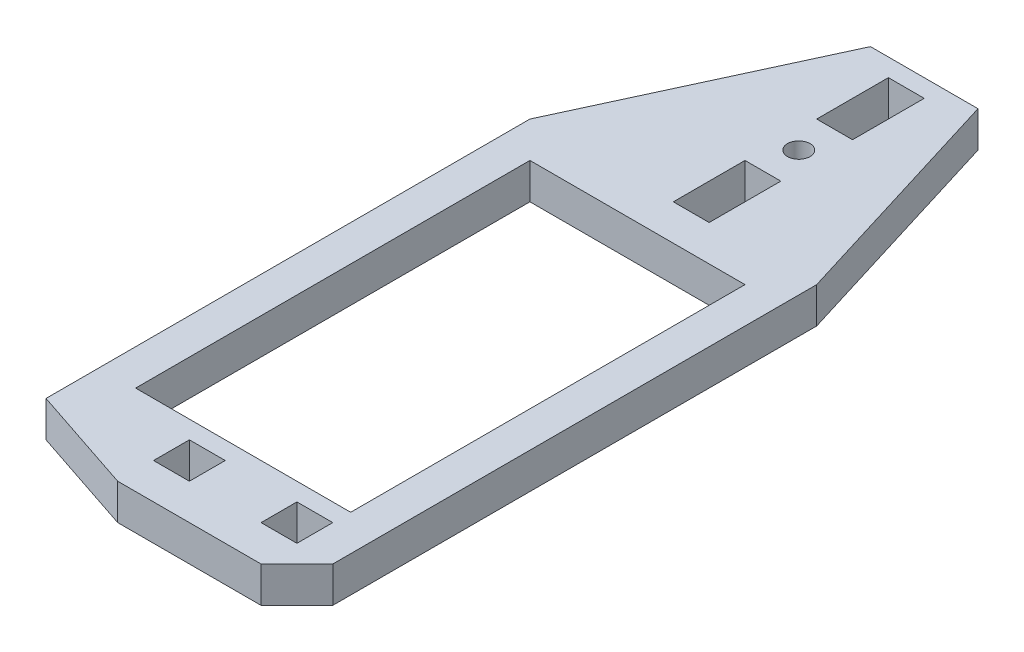
ISO-10303-21;
HEADER;
FILE_DESCRIPTION(('STEP AP214'),'2;1');
FILE_NAME('part.step','',(''),(''),'','','');
FILE_SCHEMA(('AUTOMOTIVE_DESIGN { 1 0 10303 214 1 1 1 1 }'));
ENDSEC;
DATA;
#1=APPLICATION_CONTEXT('core data for automotive mechanical design processes');
#2=APPLICATION_PROTOCOL_DEFINITION('international standard','automotive_design',2000,#1);
#3=PRODUCT_CONTEXT('',#1,'mechanical');
#4=PRODUCT('Part','Part','',(#3));
#5=PRODUCT_RELATED_PRODUCT_CATEGORY('part','',(#4));
#6=PRODUCT_DEFINITION_FORMATION('','',#4);
#7=PRODUCT_DEFINITION_CONTEXT('part definition',#1,'design');
#8=PRODUCT_DEFINITION('design','',#6,#7);
#9=PRODUCT_DEFINITION_SHAPE('','',#8);
#10=(LENGTH_UNIT() NAMED_UNIT(*) SI_UNIT(.MILLI.,.METRE.));
#11=(NAMED_UNIT(*) PLANE_ANGLE_UNIT() SI_UNIT($,.RADIAN.));
#12=(NAMED_UNIT(*) SI_UNIT($,.STERADIAN.) SOLID_ANGLE_UNIT());
#13=UNCERTAINTY_MEASURE_WITH_UNIT(LENGTH_MEASURE(1.E-05),#10,'distance_accuracy_value','');
#14=(GEOMETRIC_REPRESENTATION_CONTEXT(3) GLOBAL_UNCERTAINTY_ASSIGNED_CONTEXT((#13)) GLOBAL_UNIT_ASSIGNED_CONTEXT((#10,
#11,#12)) REPRESENTATION_CONTEXT('',''));
#15=CARTESIAN_POINT('',(0.,0.,0.));
#16=DIRECTION('',(0.,0.,1.));
#17=DIRECTION('',(1.,0.,0.));
#18=AXIS2_PLACEMENT_3D('',#15,#16,#17);
#19=CARTESIAN_POINT('',(38.1,6.35,0.));
#20=DIRECTION('',(-1.,0.,0.));
#21=DIRECTION('',(0.,0.,1.));
#22=AXIS2_PLACEMENT_3D('',#19,#20,#21);
#23=PLANE('',#22);
#24=DIRECTION('',(0.,0.,-1.));
#25=VECTOR('',#24,1.);
#26=CARTESIAN_POINT('',(38.1,0.,0.));
#27=LINE('',#26,#25);
#28=CARTESIAN_POINT('',(38.1,0.,0.));
#29=VERTEX_POINT('',#28);
#30=CARTESIAN_POINT('',(38.1,0.,-69.85));
#31=VERTEX_POINT('',#30);
#32=EDGE_CURVE('E329',#29,#31,#27,.T.);
#33=ORIENTED_EDGE('',*,*,#32,.F.);
#34=DIRECTION('',(0.,-1.,0.));
#35=VECTOR('',#34,1.);
#36=CARTESIAN_POINT('',(38.1,6.35,0.));
#37=LINE('',#36,#35);
#38=CARTESIAN_POINT('',(38.1,6.35,0.));
#39=VERTEX_POINT('',#38);
#40=EDGE_CURVE('E11',#39,#29,#37,.T.);
#41=ORIENTED_EDGE('',*,*,#40,.F.);
#42=DIRECTION('',(0.,0.,-1.));
#43=VECTOR('',#42,1.);
#44=CARTESIAN_POINT('',(38.1,6.35,0.));
#45=LINE('',#44,#43);
#46=CARTESIAN_POINT('',(38.1,6.35,-69.85));
#47=VERTEX_POINT('',#46);
#48=EDGE_CURVE('E248',#39,#47,#45,.T.);
#49=ORIENTED_EDGE('',*,*,#48,.T.);
#50=DIRECTION('',(0.,-1.,0.));
#51=VECTOR('',#50,1.);
#52=CARTESIAN_POINT('',(38.1,6.35,-69.85));
#53=LINE('',#52,#51);
#54=EDGE_CURVE('E149',#47,#31,#53,.T.);
#55=ORIENTED_EDGE('',*,*,#54,.T.);
#56=EDGE_LOOP('',(#33,#41,#49,#55));
#57=FACE_BOUND('',#56,.T.);
#58=ADVANCED_FACE('F35',(#57),#23,.T.);
#59=CARTESIAN_POINT('',(0.,6.35,0.));
#60=DIRECTION('',(0.,0.,-1.));
#61=DIRECTION('',(-1.,0.,0.));
#62=AXIS2_PLACEMENT_3D('',#59,#60,#61);
#63=PLANE('',#62);
#64=DIRECTION('',(1.,0.,0.));
#65=VECTOR('',#64,1.);
#66=CARTESIAN_POINT('',(0.,0.,0.));
#67=LINE('',#66,#65);
#68=CARTESIAN_POINT('',(0.,0.,0.));
#69=VERTEX_POINT('',#68);
#70=EDGE_CURVE('E238',#69,#29,#67,.T.);
#71=ORIENTED_EDGE('',*,*,#70,.F.);
#72=DIRECTION('',(0.,-1.,0.));
#73=VECTOR('',#72,1.);
#74=CARTESIAN_POINT('',(0.,6.35,0.));
#75=LINE('',#74,#73);
#76=CARTESIAN_POINT('',(0.,6.35,0.));
#77=VERTEX_POINT('',#76);
#78=EDGE_CURVE('E45',#77,#69,#75,.T.);
#79=ORIENTED_EDGE('',*,*,#78,.F.);
#80=DIRECTION('',(1.,0.,0.));
#81=VECTOR('',#80,1.);
#82=CARTESIAN_POINT('',(0.,6.35,0.));
#83=LINE('',#82,#81);
#84=EDGE_CURVE('E236',#77,#39,#83,.T.);
#85=ORIENTED_EDGE('',*,*,#84,.T.);
#86=ORIENTED_EDGE('',*,*,#40,.T.);
#87=EDGE_LOOP('',(#71,#79,#85,#86));
#88=FACE_BOUND('',#87,.T.);
#89=ADVANCED_FACE('F234',(#88),#63,.T.);
#90=CARTESIAN_POINT('',(0.,6.35,0.));
#91=DIRECTION('',(-1.,0.,0.));
#92=DIRECTION('',(0.,0.,1.));
#93=AXIS2_PLACEMENT_3D('',#90,#91,#92);
#94=PLANE('',#93);
#95=DIRECTION('',(0.,0.,-1.));
#96=VECTOR('',#95,1.);
#97=CARTESIAN_POINT('',(0.,0.,0.));
#98=LINE('',#97,#96);
#99=CARTESIAN_POINT('',(0.,0.,-69.85));
#100=VERTEX_POINT('',#99);
#101=EDGE_CURVE('E332',#69,#100,#98,.T.);
#102=ORIENTED_EDGE('',*,*,#101,.T.);
#103=DIRECTION('',(0.,-1.,0.));
#104=VECTOR('',#103,1.);
#105=CARTESIAN_POINT('',(0.,6.35,-69.85));
#106=LINE('',#105,#104);
#107=CARTESIAN_POINT('',(0.,6.35,-69.85));
#108=VERTEX_POINT('',#107);
#109=EDGE_CURVE('E241',#108,#100,#106,.T.);
#110=ORIENTED_EDGE('',*,*,#109,.F.);
#111=DIRECTION('',(0.,0.,-1.));
#112=VECTOR('',#111,1.);
#113=CARTESIAN_POINT('',(0.,6.35,0.));
#114=LINE('',#113,#112);
#115=EDGE_CURVE('E244',#77,#108,#114,.T.);
#116=ORIENTED_EDGE('',*,*,#115,.F.);
#117=ORIENTED_EDGE('',*,*,#78,.T.);
#118=EDGE_LOOP('',(#102,#110,#116,#117));
#119=FACE_BOUND('',#118,.T.);
#120=ADVANCED_FACE('F245',(#119),#94,.F.);
#121=CARTESIAN_POINT('',(31.75,6.35,0.));
#122=DIRECTION('',(1.,0.,0.));
#123=DIRECTION('',(0.,0.,-1.));
#124=AXIS2_PLACEMENT_3D('',#121,#122,#123);
#125=PLANE('',#124);
#126=DIRECTION('',(0.,0.,1.));
#127=VECTOR('',#126,1.);
#128=CARTESIAN_POINT('',(31.75,0.,0.));
#129=LINE('',#128,#127);
#130=CARTESIAN_POINT('',(31.75,0.,3.17499999999999));
#131=VERTEX_POINT('',#130);
#132=CARTESIAN_POINT('',(31.75,0.,9.525));
#133=VERTEX_POINT('',#132);
#134=EDGE_CURVE('E317',#131,#133,#129,.T.);
#135=ORIENTED_EDGE('',*,*,#134,.F.);
#136=DIRECTION('',(0.,-1.,0.));
#137=VECTOR('',#136,1.);
#138=CARTESIAN_POINT('',(31.75,6.35,3.17499999999999));
#139=LINE('',#138,#137);
#140=CARTESIAN_POINT('',(31.75,6.35,3.17499999999999));
#141=VERTEX_POINT('',#140);
#142=EDGE_CURVE('E337',#141,#131,#139,.T.);
#143=ORIENTED_EDGE('',*,*,#142,.F.);
#144=DIRECTION('',(0.,0.,1.));
#145=VECTOR('',#144,1.);
#146=CARTESIAN_POINT('',(31.75,6.35,0.));
#147=LINE('',#146,#145);
#148=CARTESIAN_POINT('',(31.75,6.35,9.525));
#149=VERTEX_POINT('',#148);
#150=EDGE_CURVE('E463',#141,#149,#147,.T.);
#151=ORIENTED_EDGE('',*,*,#150,.T.);
#152=DIRECTION('',(0.,-1.,0.));
#153=VECTOR('',#152,1.);
#154=CARTESIAN_POINT('',(31.75,6.35,9.525));
#155=LINE('',#154,#153);
#156=EDGE_CURVE('E339',#149,#133,#155,.T.);
#157=ORIENTED_EDGE('',*,*,#156,.T.);
#158=EDGE_LOOP('',(#135,#143,#151,#157));
#159=FACE_BOUND('',#158,.T.);
#160=ADVANCED_FACE('F481',(#159),#125,.T.);
#161=CARTESIAN_POINT('',(0.,6.35,3.175));
#162=DIRECTION('',(0.,0.,1.));
#163=DIRECTION('',(1.,0.,0.));
#164=AXIS2_PLACEMENT_3D('',#161,#162,#163);
#165=PLANE('',#164);
#166=DIRECTION('',(-1.,0.,0.));
#167=VECTOR('',#166,1.);
#168=CARTESIAN_POINT('',(0.,0.,3.175));
#169=LINE('',#168,#167);
#170=CARTESIAN_POINT('',(38.1,0.,3.17499999999999));
#171=VERTEX_POINT('',#170);
#172=EDGE_CURVE('E320',#171,#131,#169,.T.);
#173=ORIENTED_EDGE('',*,*,#172,.F.);
#174=DIRECTION('',(0.,-1.,0.));
#175=VECTOR('',#174,1.);
#176=CARTESIAN_POINT('',(38.1,6.35,3.17499999999999));
#177=LINE('',#176,#175);
#178=CARTESIAN_POINT('',(38.1,6.35,3.17499999999999));
#179=VERTEX_POINT('',#178);
#180=EDGE_CURVE('E345',#179,#171,#177,.T.);
#181=ORIENTED_EDGE('',*,*,#180,.F.);
#182=DIRECTION('',(-1.,0.,0.));
#183=VECTOR('',#182,1.);
#184=CARTESIAN_POINT('',(0.,6.35,3.175));
#185=LINE('',#184,#183);
#186=EDGE_CURVE('E466',#179,#141,#185,.T.);
#187=ORIENTED_EDGE('',*,*,#186,.T.);
#188=ORIENTED_EDGE('',*,*,#142,.T.);
#189=EDGE_LOOP('',(#173,#181,#187,#188));
#190=FACE_BOUND('',#189,.T.);
#191=ADVANCED_FACE('F484',(#190),#165,.T.);
#192=CARTESIAN_POINT('',(38.1,6.35,0.));
#193=DIRECTION('',(1.,0.,0.));
#194=DIRECTION('',(0.,0.,-1.));
#195=AXIS2_PLACEMENT_3D('',#192,#193,#194);
#196=PLANE('',#195);
#197=DIRECTION('',(0.,0.,1.));
#198=VECTOR('',#197,1.);
#199=CARTESIAN_POINT('',(38.1,0.,0.));
#200=LINE('',#199,#198);
#201=CARTESIAN_POINT('',(38.1,0.,9.525));
#202=VERTEX_POINT('',#201);
#203=EDGE_CURVE('E323',#171,#202,#200,.T.);
#204=ORIENTED_EDGE('',*,*,#203,.T.);
#205=DIRECTION('',(0.,-1.,0.));
#206=VECTOR('',#205,1.);
#207=CARTESIAN_POINT('',(38.1,6.35,9.525));
#208=LINE('',#207,#206);
#209=CARTESIAN_POINT('',(38.1,6.35,9.525));
#210=VERTEX_POINT('',#209);
#211=EDGE_CURVE('E341',#210,#202,#208,.T.);
#212=ORIENTED_EDGE('',*,*,#211,.F.);
#213=DIRECTION('',(0.,0.,1.));
#214=VECTOR('',#213,1.);
#215=CARTESIAN_POINT('',(38.1,6.35,0.));
#216=LINE('',#215,#214);
#217=EDGE_CURVE('E469',#179,#210,#216,.T.);
#218=ORIENTED_EDGE('',*,*,#217,.F.);
#219=ORIENTED_EDGE('',*,*,#180,.T.);
#220=EDGE_LOOP('',(#204,#212,#218,#219));
#221=FACE_BOUND('',#220,.T.);
#222=ADVANCED_FACE('F487',(#221),#196,.F.);
#223=CARTESIAN_POINT('',(12.7,6.35,0.));
#224=DIRECTION('',(1.,0.,0.));
#225=DIRECTION('',(0.,0.,-1.));
#226=AXIS2_PLACEMENT_3D('',#223,#224,#225);
#227=PLANE('',#226);
#228=DIRECTION('',(0.,0.,1.));
#229=VECTOR('',#228,1.);
#230=CARTESIAN_POINT('',(12.7,0.,0.));
#231=LINE('',#230,#229);
#232=CARTESIAN_POINT('',(12.7,0.,3.175));
#233=VERTEX_POINT('',#232);
#234=CARTESIAN_POINT('',(12.7,0.,9.525));
#235=VERTEX_POINT('',#234);
#236=EDGE_CURVE('E305',#233,#235,#231,.T.);
#237=ORIENTED_EDGE('',*,*,#236,.F.);
#238=DIRECTION('',(0.,-1.,0.));
#239=VECTOR('',#238,1.);
#240=CARTESIAN_POINT('',(12.7,6.35,3.175));
#241=LINE('',#240,#239);
#242=CARTESIAN_POINT('',(12.7,6.35,3.175));
#243=VERTEX_POINT('',#242);
#244=EDGE_CURVE('E342',#243,#233,#241,.T.);
#245=ORIENTED_EDGE('',*,*,#244,.F.);
#246=DIRECTION('',(0.,0.,1.));
#247=VECTOR('',#246,1.);
#248=CARTESIAN_POINT('',(12.7,6.35,0.));
#249=LINE('',#248,#247);
#250=CARTESIAN_POINT('',(12.7,6.35,9.525));
#251=VERTEX_POINT('',#250);
#252=EDGE_CURVE('E452',#243,#251,#249,.T.);
#253=ORIENTED_EDGE('',*,*,#252,.T.);
#254=DIRECTION('',(0.,-1.,0.));
#255=VECTOR('',#254,1.);
#256=CARTESIAN_POINT('',(12.7,6.35,9.525));
#257=LINE('',#256,#255);
#258=EDGE_CURVE('E348',#251,#235,#257,.T.);
#259=ORIENTED_EDGE('',*,*,#258,.T.);
#260=EDGE_LOOP('',(#237,#245,#253,#259));
#261=FACE_BOUND('',#260,.T.);
#262=ADVANCED_FACE('F505',(#261),#227,.T.);
#263=CARTESIAN_POINT('',(0.,6.35,3.175));
#264=DIRECTION('',(0.,0.,1.));
#265=DIRECTION('',(1.,0.,0.));
#266=AXIS2_PLACEMENT_3D('',#263,#264,#265);
#267=PLANE('',#266);
#268=DIRECTION('',(-1.,0.,0.));
#269=VECTOR('',#268,1.);
#270=CARTESIAN_POINT('',(0.,0.,3.175));
#271=LINE('',#270,#269);
#272=CARTESIAN_POINT('',(19.05,0.,3.175));
#273=VERTEX_POINT('',#272);
#274=EDGE_CURVE('E308',#273,#233,#271,.T.);
#275=ORIENTED_EDGE('',*,*,#274,.F.);
#276=DIRECTION('',(0.,-1.,0.));
#277=VECTOR('',#276,1.);
#278=CARTESIAN_POINT('',(19.05,6.35,3.175));
#279=LINE('',#278,#277);
#280=CARTESIAN_POINT('',(19.05,6.35,3.175));
#281=VERTEX_POINT('',#280);
#282=EDGE_CURVE('E354',#281,#273,#279,.T.);
#283=ORIENTED_EDGE('',*,*,#282,.F.);
#284=DIRECTION('',(-1.,0.,0.));
#285=VECTOR('',#284,1.);
#286=CARTESIAN_POINT('',(0.,6.35,3.175));
#287=LINE('',#286,#285);
#288=EDGE_CURVE('E455',#281,#243,#287,.T.);
#289=ORIENTED_EDGE('',*,*,#288,.T.);
#290=ORIENTED_EDGE('',*,*,#244,.T.);
#291=EDGE_LOOP('',(#275,#283,#289,#290));
#292=FACE_BOUND('',#291,.T.);
#293=ADVANCED_FACE('F518',(#292),#267,.T.);
#294=CARTESIAN_POINT('',(19.05,6.35,0.));
#295=DIRECTION('',(1.,0.,0.));
#296=DIRECTION('',(0.,0.,-1.));
#297=AXIS2_PLACEMENT_3D('',#294,#295,#296);
#298=PLANE('',#297);
#299=DIRECTION('',(0.,0.,1.));
#300=VECTOR('',#299,1.);
#301=CARTESIAN_POINT('',(19.05,0.,0.));
#302=LINE('',#301,#300);
#303=CARTESIAN_POINT('',(19.05,0.,9.525));
#304=VERTEX_POINT('',#303);
#305=EDGE_CURVE('E311',#273,#304,#302,.T.);
#306=ORIENTED_EDGE('',*,*,#305,.T.);
#307=DIRECTION('',(0.,-1.,0.));
#308=VECTOR('',#307,1.);
#309=CARTESIAN_POINT('',(19.05,6.35,9.525));
#310=LINE('',#309,#308);
#311=CARTESIAN_POINT('',(19.05,6.35,9.525));
#312=VERTEX_POINT('',#311);
#313=EDGE_CURVE('E350',#312,#304,#310,.T.);
#314=ORIENTED_EDGE('',*,*,#313,.F.);
#315=DIRECTION('',(0.,0.,1.));
#316=VECTOR('',#315,1.);
#317=CARTESIAN_POINT('',(19.05,6.35,0.));
#318=LINE('',#317,#316);
#319=EDGE_CURVE('E458',#281,#312,#318,.T.);
#320=ORIENTED_EDGE('',*,*,#319,.F.);
#321=ORIENTED_EDGE('',*,*,#282,.T.);
#322=EDGE_LOOP('',(#306,#314,#320,#321));
#323=FACE_BOUND('',#322,.T.);
#324=ADVANCED_FACE('F514',(#323),#298,.F.);
#325=CARTESIAN_POINT('',(25.4,6.35,0.));
#326=DIRECTION('',(-1.,0.,0.));
#327=DIRECTION('',(0.,0.,1.));
#328=AXIS2_PLACEMENT_3D('',#325,#326,#327);
#329=PLANE('',#328);
#330=DIRECTION('',(0.,0.,-1.));
#331=VECTOR('',#330,1.);
#332=CARTESIAN_POINT('',(25.4,0.,0.));
#333=LINE('',#332,#331);
#334=CARTESIAN_POINT('',(25.4,0.,-101.6));
#335=VERTEX_POINT('',#334);
#336=CARTESIAN_POINT('',(25.4,0.,-114.3));
#337=VERTEX_POINT('',#336);
#338=EDGE_CURVE('E293',#335,#337,#333,.T.);
#339=ORIENTED_EDGE('',*,*,#338,.F.);
#340=DIRECTION('',(0.,-1.,0.));
#341=VECTOR('',#340,1.);
#342=CARTESIAN_POINT('',(25.4,6.35,-101.6));
#343=LINE('',#342,#341);
#344=CARTESIAN_POINT('',(25.4,6.35,-101.6));
#345=VERTEX_POINT('',#344);
#346=EDGE_CURVE('E351',#345,#335,#343,.T.);
#347=ORIENTED_EDGE('',*,*,#346,.F.);
#348=DIRECTION('',(0.,0.,-1.));
#349=VECTOR('',#348,1.);
#350=CARTESIAN_POINT('',(25.4,6.35,0.));
#351=LINE('',#350,#349);
#352=CARTESIAN_POINT('',(25.4,6.35,-114.3));
#353=VERTEX_POINT('',#352);
#354=EDGE_CURVE('E441',#345,#353,#351,.T.);
#355=ORIENTED_EDGE('',*,*,#354,.T.);
#356=DIRECTION('',(0.,-1.,0.));
#357=VECTOR('',#356,1.);
#358=CARTESIAN_POINT('',(25.4,6.35,-114.3));
#359=LINE('',#358,#357);
#360=EDGE_CURVE('E357',#353,#337,#359,.T.);
#361=ORIENTED_EDGE('',*,*,#360,.T.);
#362=EDGE_LOOP('',(#339,#347,#355,#361));
#363=FACE_BOUND('',#362,.T.);
#364=ADVANCED_FACE('F517',(#363),#329,.T.);
#365=CARTESIAN_POINT('',(0.,6.35,-101.6));
#366=DIRECTION('',(0.,0.,-1.));
#367=DIRECTION('',(-1.,0.,0.));
#368=AXIS2_PLACEMENT_3D('',#365,#366,#367);
#369=PLANE('',#368);
#370=DIRECTION('',(1.,0.,0.));
#371=VECTOR('',#370,1.);
#372=CARTESIAN_POINT('',(0.,0.,-101.6));
#373=LINE('',#372,#371);
#374=CARTESIAN_POINT('',(19.05,0.,-101.6));
#375=VERTEX_POINT('',#374);
#376=EDGE_CURVE('E296',#375,#335,#373,.T.);
#377=ORIENTED_EDGE('',*,*,#376,.F.);
#378=DIRECTION('',(0.,-1.,0.));
#379=VECTOR('',#378,1.);
#380=CARTESIAN_POINT('',(19.05,6.35,-101.6));
#381=LINE('',#380,#379);
#382=CARTESIAN_POINT('',(19.05,6.35,-101.6));
#383=VERTEX_POINT('',#382);
#384=EDGE_CURVE('E363',#383,#375,#381,.T.);
#385=ORIENTED_EDGE('',*,*,#384,.F.);
#386=DIRECTION('',(1.,0.,0.));
#387=VECTOR('',#386,1.);
#388=CARTESIAN_POINT('',(0.,6.35,-101.6));
#389=LINE('',#388,#387);
#390=EDGE_CURVE('E444',#383,#345,#389,.T.);
#391=ORIENTED_EDGE('',*,*,#390,.T.);
#392=ORIENTED_EDGE('',*,*,#346,.T.);
#393=EDGE_LOOP('',(#377,#385,#391,#392));
#394=FACE_BOUND('',#393,.T.);
#395=ADVANCED_FACE('F534',(#394),#369,.T.);
#396=CARTESIAN_POINT('',(19.05,6.35,0.));
#397=DIRECTION('',(-1.,0.,0.));
#398=DIRECTION('',(0.,0.,1.));
#399=AXIS2_PLACEMENT_3D('',#396,#397,#398);
#400=PLANE('',#399);
#401=DIRECTION('',(0.,0.,-1.));
#402=VECTOR('',#401,1.);
#403=CARTESIAN_POINT('',(19.05,0.,0.));
#404=LINE('',#403,#402);
#405=CARTESIAN_POINT('',(19.05,0.,-114.3));
#406=VERTEX_POINT('',#405);
#407=EDGE_CURVE('E299',#375,#406,#404,.T.);
#408=ORIENTED_EDGE('',*,*,#407,.T.);
#409=DIRECTION('',(0.,-1.,0.));
#410=VECTOR('',#409,1.);
#411=CARTESIAN_POINT('',(19.05,6.35,-114.3));
#412=LINE('',#411,#410);
#413=CARTESIAN_POINT('',(19.05,6.35,-114.3));
#414=VERTEX_POINT('',#413);
#415=EDGE_CURVE('E359',#414,#406,#412,.T.);
#416=ORIENTED_EDGE('',*,*,#415,.F.);
#417=DIRECTION('',(0.,0.,-1.));
#418=VECTOR('',#417,1.);
#419=CARTESIAN_POINT('',(19.05,6.35,0.));
#420=LINE('',#419,#418);
#421=EDGE_CURVE('E447',#383,#414,#420,.T.);
#422=ORIENTED_EDGE('',*,*,#421,.F.);
#423=ORIENTED_EDGE('',*,*,#384,.T.);
#424=EDGE_LOOP('',(#408,#416,#422,#423));
#425=FACE_BOUND('',#424,.T.);
#426=ADVANCED_FACE('F530',(#425),#400,.F.);
#427=CARTESIAN_POINT('',(0.,6.35,-76.2));
#428=DIRECTION('',(0.,0.,-1.));
#429=DIRECTION('',(-1.,0.,0.));
#430=AXIS2_PLACEMENT_3D('',#427,#428,#429);
#431=PLANE('',#430);
#432=DIRECTION('',(1.,0.,0.));
#433=VECTOR('',#432,1.);
#434=CARTESIAN_POINT('',(0.,0.,-76.2));
#435=LINE('',#434,#433);
#436=CARTESIAN_POINT('',(19.05,0.,-76.2));
#437=VERTEX_POINT('',#436);
#438=CARTESIAN_POINT('',(25.4,0.,-76.2));
#439=VERTEX_POINT('',#438);
#440=EDGE_CURVE('E278',#437,#439,#435,.T.);
#441=ORIENTED_EDGE('',*,*,#440,.F.);
#442=DIRECTION('',(0.,-1.,0.));
#443=VECTOR('',#442,1.);
#444=CARTESIAN_POINT('',(19.05,6.35,-76.2));
#445=LINE('',#444,#443);
#446=CARTESIAN_POINT('',(19.05,6.35,-76.2));
#447=VERTEX_POINT('',#446);
#448=EDGE_CURVE('E360',#447,#437,#445,.T.);
#449=ORIENTED_EDGE('',*,*,#448,.F.);
#450=DIRECTION('',(1.,0.,0.));
#451=VECTOR('',#450,1.);
#452=CARTESIAN_POINT('',(0.,6.35,-76.2));
#453=LINE('',#452,#451);
#454=CARTESIAN_POINT('',(25.4,6.35,-76.2));
#455=VERTEX_POINT('',#454);
#456=EDGE_CURVE('E427',#447,#455,#453,.T.);
#457=ORIENTED_EDGE('',*,*,#456,.T.);
#458=DIRECTION('',(0.,-1.,0.));
#459=VECTOR('',#458,1.);
#460=CARTESIAN_POINT('',(25.4,6.35,-76.2));
#461=LINE('',#460,#459);
#462=EDGE_CURVE('E366',#455,#439,#461,.T.);
#463=ORIENTED_EDGE('',*,*,#462,.T.);
#464=EDGE_LOOP('',(#441,#449,#457,#463));
#465=FACE_BOUND('',#464,.T.);
#466=ADVANCED_FACE('F533',(#465),#431,.T.);
#467=CARTESIAN_POINT('',(19.05,6.35,0.));
#468=DIRECTION('',(-1.,0.,0.));
#469=DIRECTION('',(0.,0.,1.));
#470=AXIS2_PLACEMENT_3D('',#467,#468,#469);
#471=PLANE('',#470);
#472=DIRECTION('',(0.,0.,-1.));
#473=VECTOR('',#472,1.);
#474=CARTESIAN_POINT('',(19.05,0.,0.));
#475=LINE('',#474,#473);
#476=CARTESIAN_POINT('',(19.05,0.,-88.9));
#477=VERTEX_POINT('',#476);
#478=EDGE_CURVE('E281',#437,#477,#475,.T.);
#479=ORIENTED_EDGE('',*,*,#478,.T.);
#480=DIRECTION('',(0.,-1.,0.));
#481=VECTOR('',#480,1.);
#482=CARTESIAN_POINT('',(19.05,6.35,-88.9));
#483=LINE('',#482,#481);
#484=CARTESIAN_POINT('',(19.05,6.35,-88.9));
#485=VERTEX_POINT('',#484);
#486=EDGE_CURVE('E370',#485,#477,#483,.T.);
#487=ORIENTED_EDGE('',*,*,#486,.F.);
#488=DIRECTION('',(0.,0.,-1.));
#489=VECTOR('',#488,1.);
#490=CARTESIAN_POINT('',(19.05,6.35,0.));
#491=LINE('',#490,#489);
#492=EDGE_CURVE('E430',#447,#485,#491,.T.);
#493=ORIENTED_EDGE('',*,*,#492,.F.);
#494=ORIENTED_EDGE('',*,*,#448,.T.);
#495=EDGE_LOOP('',(#479,#487,#493,#494));
#496=FACE_BOUND('',#495,.T.);
#497=ADVANCED_FACE('F553',(#496),#471,.F.);
#498=CARTESIAN_POINT('',(0.,6.35,-88.9));
#499=DIRECTION('',(0.,0.,-1.));
#500=DIRECTION('',(-1.,0.,0.));
#501=AXIS2_PLACEMENT_3D('',#498,#499,#500);
#502=PLANE('',#501);
#503=DIRECTION('',(1.,0.,0.));
#504=VECTOR('',#503,1.);
#505=CARTESIAN_POINT('',(0.,0.,-88.9));
#506=LINE('',#505,#504);
#507=CARTESIAN_POINT('',(25.4,0.,-88.9));
#508=VERTEX_POINT('',#507);
#509=EDGE_CURVE('E284',#477,#508,#506,.T.);
#510=ORIENTED_EDGE('',*,*,#509,.T.);
#511=DIRECTION('',(0.,-1.,0.));
#512=VECTOR('',#511,1.);
#513=CARTESIAN_POINT('',(25.4,6.35,-88.9));
#514=LINE('',#513,#512);
#515=CARTESIAN_POINT('',(25.4,6.35,-88.9));
#516=VERTEX_POINT('',#515);
#517=EDGE_CURVE('E368',#516,#508,#514,.T.);
#518=ORIENTED_EDGE('',*,*,#517,.F.);
#519=DIRECTION('',(1.,0.,0.));
#520=VECTOR('',#519,1.);
#521=CARTESIAN_POINT('',(0.,6.35,-88.9));
#522=LINE('',#521,#520);
#523=EDGE_CURVE('E433',#485,#516,#522,.T.);
#524=ORIENTED_EDGE('',*,*,#523,.F.);
#525=ORIENTED_EDGE('',*,*,#486,.T.);
#526=EDGE_LOOP('',(#510,#518,#524,#525));
#527=FACE_BOUND('',#526,.T.);
#528=ADVANCED_FACE('F550',(#527),#502,.F.);
#529=CARTESIAN_POINT('',(44.45,6.35,0.));
#530=DIRECTION('',(-1.,0.,0.));
#531=DIRECTION('',(0.,0.,1.));
#532=AXIS2_PLACEMENT_3D('',#529,#530,#531);
#533=PLANE('',#532);
#534=DIRECTION('',(0.,0.,-1.));
#535=VECTOR('',#534,1.);
#536=CARTESIAN_POINT('',(44.45,0.,0.));
#537=LINE('',#536,#535);
#538=CARTESIAN_POINT('',(44.45,0.,9.525));
#539=VERTEX_POINT('',#538);
#540=CARTESIAN_POINT('',(44.45,0.,-76.2));
#541=VERTEX_POINT('',#540);
#542=EDGE_CURVE('E256',#539,#541,#537,.T.);
#543=ORIENTED_EDGE('',*,*,#542,.T.);
#544=DIRECTION('',(0.,-1.,0.));
#545=VECTOR('',#544,1.);
#546=CARTESIAN_POINT('',(44.45,6.35,-76.2));
#547=LINE('',#546,#545);
#548=CARTESIAN_POINT('',(44.45,6.35,-76.2));
#549=VERTEX_POINT('',#548);
#550=EDGE_CURVE('E39',#549,#541,#547,.T.);
#551=ORIENTED_EDGE('',*,*,#550,.F.);
#552=DIRECTION('',(0.,0.,-1.));
#553=VECTOR('',#552,1.);
#554=CARTESIAN_POINT('',(44.45,6.35,0.));
#555=LINE('',#554,#553);
#556=CARTESIAN_POINT('',(44.45,6.35,9.525));
#557=VERTEX_POINT('',#556);
#558=EDGE_CURVE('E335',#557,#549,#555,.T.);
#559=ORIENTED_EDGE('',*,*,#558,.F.);
#560=DIRECTION('',(0.,-1.,0.));
#561=VECTOR('',#560,1.);
#562=CARTESIAN_POINT('',(44.45,6.35,9.525));
#563=LINE('',#562,#561);
#564=EDGE_CURVE('E255',#557,#539,#563,.T.);
#565=ORIENTED_EDGE('',*,*,#564,.T.);
#566=EDGE_LOOP('',(#543,#551,#559,#565));
#567=FACE_BOUND('',#566,.T.);
#568=ADVANCED_FACE('F37',(#567),#533,.F.);
#569=CARTESIAN_POINT('',(62.0240540540541,6.35,-19.0843243243243));
#570=DIRECTION('',(-0.95577900872195,0.,0.294085848837523));
#571=DIRECTION('',(0.294085848837523,0.,0.95577900872195));
#572=AXIS2_PLACEMENT_3D('',#569,#570,#571);
#573=PLANE('',#572);
#574=DIRECTION('',(-0.294085848837523,0.,-0.95577900872195));
#575=VECTOR('',#574,1.);
#576=CARTESIAN_POINT('',(62.0240540540541,0.,-19.0843243243243));
#577=LINE('',#576,#575);
#578=CARTESIAN_POINT('',(31.75,0.,-117.475));
#579=VERTEX_POINT('',#578);
#580=EDGE_CURVE('E259',#541,#579,#577,.T.);
#581=ORIENTED_EDGE('',*,*,#580,.T.);
#582=DIRECTION('',(0.,-1.,0.));
#583=VECTOR('',#582,1.);
#584=CARTESIAN_POINT('',(31.75,6.35,-117.475));
#585=LINE('',#584,#583);
#586=CARTESIAN_POINT('',(31.75,6.35,-117.475));
#587=VERTEX_POINT('',#586);
#588=EDGE_CURVE('E386',#587,#579,#585,.T.);
#589=ORIENTED_EDGE('',*,*,#588,.F.);
#590=DIRECTION('',(-0.294085848837523,0.,-0.95577900872195));
#591=VECTOR('',#590,1.);
#592=CARTESIAN_POINT('',(62.0240540540541,6.35,-19.0843243243243));
#593=LINE('',#592,#591);
#594=EDGE_CURVE('E157',#549,#587,#593,.T.);
#595=ORIENTED_EDGE('',*,*,#594,.F.);
#596=ORIENTED_EDGE('',*,*,#550,.T.);
#597=EDGE_LOOP('',(#581,#589,#595,#596));
#598=FACE_BOUND('',#597,.T.);
#599=ADVANCED_FACE('F391',(#598),#573,.F.);
#600=CARTESIAN_POINT('',(0.,6.35,-117.475));
#601=DIRECTION('',(0.,0.,-1.));
#602=DIRECTION('',(-1.,0.,0.));
#603=AXIS2_PLACEMENT_3D('',#600,#601,#602);
#604=PLANE('',#603);
#605=DIRECTION('',(1.,0.,0.));
#606=VECTOR('',#605,1.);
#607=CARTESIAN_POINT('',(0.,0.,-117.475));
#608=LINE('',#607,#606);
#609=CARTESIAN_POINT('',(12.7,0.,-117.475));
#610=VERTEX_POINT('',#609);
#611=EDGE_CURVE('E262',#610,#579,#608,.T.);
#612=ORIENTED_EDGE('',*,*,#611,.F.);
#613=DIRECTION('',(0.,-1.,0.));
#614=VECTOR('',#613,1.);
#615=CARTESIAN_POINT('',(12.7,6.35,-117.475));
#616=LINE('',#615,#614);
#617=CARTESIAN_POINT('',(12.7,6.35,-117.475));
#618=VERTEX_POINT('',#617);
#619=EDGE_CURVE('E385',#618,#610,#616,.T.);
#620=ORIENTED_EDGE('',*,*,#619,.F.);
#621=DIRECTION('',(1.,0.,0.));
#622=VECTOR('',#621,1.);
#623=CARTESIAN_POINT('',(0.,6.35,-117.475));
#624=LINE('',#623,#622);
#625=EDGE_CURVE('E404',#618,#587,#624,.T.);
#626=ORIENTED_EDGE('',*,*,#625,.T.);
#627=ORIENTED_EDGE('',*,*,#588,.T.);
#628=EDGE_LOOP('',(#612,#620,#626,#627));
#629=FACE_BOUND('',#628,.T.);
#630=ADVANCED_FACE('F402',(#629),#604,.T.);
#631=CARTESIAN_POINT('',(-34.2280487804878,6.35,-15.7975609756097));
#632=DIRECTION('',(-0.907959384500452,0.,-0.419058177461747));
#633=DIRECTION('',(-0.419058177461747,0.,0.907959384500452));
#634=AXIS2_PLACEMENT_3D('',#631,#632,#633);
#635=PLANE('',#634);
#636=DIRECTION('',(0.419058177461747,0.,-0.907959384500452));
#637=VECTOR('',#636,1.);
#638=CARTESIAN_POINT('',(-34.2280487804878,0.,-15.7975609756097));
#639=LINE('',#638,#637);
#640=CARTESIAN_POINT('',(-6.35,0.,-76.2));
#641=VERTEX_POINT('',#640);
#642=EDGE_CURVE('E265',#641,#610,#639,.T.);
#643=ORIENTED_EDGE('',*,*,#642,.F.);
#644=DIRECTION('',(0.,-1.,0.));
#645=VECTOR('',#644,1.);
#646=CARTESIAN_POINT('',(-6.35,6.35,-76.2));
#647=LINE('',#646,#645);
#648=CARTESIAN_POINT('',(-6.35,6.35,-76.2));
#649=VERTEX_POINT('',#648);
#650=EDGE_CURVE('E383',#649,#641,#647,.T.);
#651=ORIENTED_EDGE('',*,*,#650,.F.);
#652=DIRECTION('',(0.419058177461747,0.,-0.907959384500452));
#653=VECTOR('',#652,1.);
#654=CARTESIAN_POINT('',(-34.2280487804878,6.35,-15.7975609756097));
#655=LINE('',#654,#653);
#656=EDGE_CURVE('E411',#649,#618,#655,.T.);
#657=ORIENTED_EDGE('',*,*,#656,.T.);
#658=ORIENTED_EDGE('',*,*,#619,.T.);
#659=EDGE_LOOP('',(#643,#651,#657,#658));
#660=FACE_BOUND('',#659,.T.);
#661=ADVANCED_FACE('F414',(#660),#635,.T.);
#662=CARTESIAN_POINT('',(-6.35,6.35,0.));
#663=DIRECTION('',(-1.,0.,0.));
#664=DIRECTION('',(0.,0.,1.));
#665=AXIS2_PLACEMENT_3D('',#662,#663,#664);
#666=PLANE('',#665);
#667=DIRECTION('',(0.,0.,-1.));
#668=VECTOR('',#667,1.);
#669=CARTESIAN_POINT('',(-6.35,0.,0.));
#670=LINE('',#669,#668);
#671=CARTESIAN_POINT('',(-6.35,0.,9.525));
#672=VERTEX_POINT('',#671);
#673=EDGE_CURVE('E268',#672,#641,#670,.T.);
#674=ORIENTED_EDGE('',*,*,#673,.F.);
#675=DIRECTION('',(0.,-1.,0.));
#676=VECTOR('',#675,1.);
#677=CARTESIAN_POINT('',(-6.35,6.35,9.525));
#678=LINE('',#677,#676);
#679=CARTESIAN_POINT('',(-6.35,6.35,9.525));
#680=VERTEX_POINT('',#679);
#681=EDGE_CURVE('E381',#680,#672,#678,.T.);
#682=ORIENTED_EDGE('',*,*,#681,.F.);
#683=DIRECTION('',(0.,0.,-1.));
#684=VECTOR('',#683,1.);
#685=CARTESIAN_POINT('',(-6.35,6.35,0.));
#686=LINE('',#685,#684);
#687=EDGE_CURVE('E415',#680,#649,#686,.T.);
#688=ORIENTED_EDGE('',*,*,#687,.T.);
#689=ORIENTED_EDGE('',*,*,#650,.T.);
#690=EDGE_LOOP('',(#674,#682,#688,#689));
#691=FACE_BOUND('',#690,.T.);
#692=ADVANCED_FACE('F571',(#691),#666,.T.);
#693=CARTESIAN_POINT('',(-3.4925,6.35,10.4775));
#694=DIRECTION('',(-0.316227766016838,0.,0.948683298050514));
#695=DIRECTION('',(0.948683298050514,0.,0.316227766016838));
#696=AXIS2_PLACEMENT_3D('',#693,#694,#695);
#697=PLANE('',#696);
#698=DIRECTION('',(-0.948683298050514,0.,-0.316227766016838));
#699=VECTOR('',#698,1.);
#700=CARTESIAN_POINT('',(-3.4925,0.,10.4775));
#701=LINE('',#700,#699);
#702=CARTESIAN_POINT('',(12.7,0.,15.875));
#703=VERTEX_POINT('',#702);
#704=EDGE_CURVE('E271',#703,#672,#701,.T.);
#705=ORIENTED_EDGE('',*,*,#704,.F.);
#706=DIRECTION('',(0.,-1.,0.));
#707=VECTOR('',#706,1.);
#708=CARTESIAN_POINT('',(12.7,6.35,15.875));
#709=LINE('',#708,#707);
#710=CARTESIAN_POINT('',(12.7,6.35,15.875));
#711=VERTEX_POINT('',#710);
#712=EDGE_CURVE('E379',#711,#703,#709,.T.);
#713=ORIENTED_EDGE('',*,*,#712,.F.);
#714=DIRECTION('',(-0.948683298050514,0.,-0.316227766016838));
#715=VECTOR('',#714,1.);
#716=CARTESIAN_POINT('',(-3.4925,6.35,10.4775));
#717=LINE('',#716,#715);
#718=EDGE_CURVE('E417',#711,#680,#717,.T.);
#719=ORIENTED_EDGE('',*,*,#718,.T.);
#720=ORIENTED_EDGE('',*,*,#681,.T.);
#721=EDGE_LOOP('',(#705,#713,#719,#720));
#722=FACE_BOUND('',#721,.T.);
#723=ADVANCED_FACE('F567',(#722),#697,.T.);
#724=CARTESIAN_POINT('',(0.,6.35,15.875));
#725=DIRECTION('',(0.,0.,-1.));
#726=DIRECTION('',(-1.,0.,0.));
#727=AXIS2_PLACEMENT_3D('',#724,#725,#726);
#728=PLANE('',#727);
#729=DIRECTION('',(1.,0.,0.));
#730=VECTOR('',#729,1.);
#731=CARTESIAN_POINT('',(0.,0.,15.875));
#732=LINE('',#731,#730);
#733=CARTESIAN_POINT('',(38.1,0.,15.875));
#734=VERTEX_POINT('',#733);
#735=EDGE_CURVE('E274',#703,#734,#732,.T.);
#736=ORIENTED_EDGE('',*,*,#735,.T.);
#737=DIRECTION('',(0.,-1.,0.));
#738=VECTOR('',#737,1.);
#739=CARTESIAN_POINT('',(38.1,6.35,15.875));
#740=LINE('',#739,#738);
#741=CARTESIAN_POINT('',(38.1,6.35,15.875));
#742=VERTEX_POINT('',#741);
#743=EDGE_CURVE('E376',#742,#734,#740,.T.);
#744=ORIENTED_EDGE('',*,*,#743,.F.);
#745=DIRECTION('',(1.,0.,0.));
#746=VECTOR('',#745,1.);
#747=CARTESIAN_POINT('',(0.,6.35,15.875));
#748=LINE('',#747,#746);
#749=EDGE_CURVE('E423',#711,#742,#748,.T.);
#750=ORIENTED_EDGE('',*,*,#749,.F.);
#751=ORIENTED_EDGE('',*,*,#712,.T.);
#752=EDGE_LOOP('',(#736,#744,#750,#751));
#753=FACE_BOUND('',#752,.T.);
#754=ADVANCED_FACE('F502',(#753),#728,.F.);
#755=CARTESIAN_POINT('',(0.,6.35,9.52500000000001));
#756=DIRECTION('',(0.,0.,1.));
#757=DIRECTION('',(1.,0.,0.));
#758=AXIS2_PLACEMENT_3D('',#755,#756,#757);
#759=PLANE('',#758);
#760=DIRECTION('',(-1.,0.,0.));
#761=VECTOR('',#760,1.);
#762=CARTESIAN_POINT('',(0.,0.,9.52500000000001));
#763=LINE('',#762,#761);
#764=EDGE_CURVE('E326',#202,#133,#763,.T.);
#765=ORIENTED_EDGE('',*,*,#764,.T.);
#766=ORIENTED_EDGE('',*,*,#156,.F.);
#767=DIRECTION('',(-1.,0.,0.));
#768=VECTOR('',#767,1.);
#769=CARTESIAN_POINT('',(0.,6.35,9.52500000000001));
#770=LINE('',#769,#768);
#771=EDGE_CURVE('E250',#210,#149,#770,.T.);
#772=ORIENTED_EDGE('',*,*,#771,.F.);
#773=ORIENTED_EDGE('',*,*,#211,.T.);
#774=EDGE_LOOP('',(#765,#766,#772,#773));
#775=FACE_BOUND('',#774,.T.);
#776=ADVANCED_FACE('F478',(#775),#759,.F.);
#777=CARTESIAN_POINT('',(0.,6.35,9.525));
#778=DIRECTION('',(0.,0.,1.));
#779=DIRECTION('',(1.,0.,0.));
#780=AXIS2_PLACEMENT_3D('',#777,#778,#779);
#781=PLANE('',#780);
#782=DIRECTION('',(-1.,0.,0.));
#783=VECTOR('',#782,1.);
#784=CARTESIAN_POINT('',(0.,0.,9.525));
#785=LINE('',#784,#783);
#786=EDGE_CURVE('E314',#304,#235,#785,.T.);
#787=ORIENTED_EDGE('',*,*,#786,.T.);
#788=ORIENTED_EDGE('',*,*,#258,.F.);
#789=DIRECTION('',(-1.,0.,0.));
#790=VECTOR('',#789,1.);
#791=CARTESIAN_POINT('',(0.,6.35,9.525));
#792=LINE('',#791,#790);
#793=EDGE_CURVE('E461',#312,#251,#792,.T.);
#794=ORIENTED_EDGE('',*,*,#793,.F.);
#795=ORIENTED_EDGE('',*,*,#313,.T.);
#796=EDGE_LOOP('',(#787,#788,#794,#795));
#797=FACE_BOUND('',#796,.T.);
#798=ADVANCED_FACE('F501',(#797),#781,.F.);
#799=CARTESIAN_POINT('',(0.,6.35,-114.3));
#800=DIRECTION('',(0.,0.,-1.));
#801=DIRECTION('',(-1.,0.,0.));
#802=AXIS2_PLACEMENT_3D('',#799,#800,#801);
#803=PLANE('',#802);
#804=DIRECTION('',(1.,0.,0.));
#805=VECTOR('',#804,1.);
#806=CARTESIAN_POINT('',(0.,0.,-114.3));
#807=LINE('',#806,#805);
#808=EDGE_CURVE('E302',#406,#337,#807,.T.);
#809=ORIENTED_EDGE('',*,*,#808,.T.);
#810=ORIENTED_EDGE('',*,*,#360,.F.);
#811=DIRECTION('',(1.,0.,0.));
#812=VECTOR('',#811,1.);
#813=CARTESIAN_POINT('',(0.,6.35,-114.3));
#814=LINE('',#813,#812);
#815=EDGE_CURVE('E450',#414,#353,#814,.T.);
#816=ORIENTED_EDGE('',*,*,#815,.F.);
#817=ORIENTED_EDGE('',*,*,#415,.T.);
#818=EDGE_LOOP('',(#809,#810,#816,#817));
#819=FACE_BOUND('',#818,.T.);
#820=ADVANCED_FACE('F512',(#819),#803,.F.);
#821=CARTESIAN_POINT('',(22.225,6.35,-95.25));
#822=DIRECTION('',(0.,-1.,0.));
#823=DIRECTION('',(0.,0.,-1.));
#824=AXIS2_PLACEMENT_3D('',#821,#822,#823);
#825=CYLINDRICAL_SURFACE('',#824,2.);
#826=CARTESIAN_POINT('',(22.225,6.35,-95.25));
#827=DIRECTION('',(0.,1.,0.));
#828=DIRECTION('',(0.,0.,1.));
#829=AXIS2_PLACEMENT_3D('',#826,#827,#828);
#830=CIRCLE('',#829,2.);
#831=CARTESIAN_POINT('',(22.225,6.35,-93.25));
#832=VERTEX_POINT('',#831);
#833=EDGE_CURVE('E438',#832,#832,#830,.T.);
#834=ORIENTED_EDGE('',*,*,#833,.T.);
#835=EDGE_LOOP('',(#834));
#836=FACE_BOUND('',#835,.T.);
#837=CARTESIAN_POINT('',(22.225,0.,-95.25));
#838=DIRECTION('',(0.,1.,0.));
#839=DIRECTION('',(0.,0.,1.));
#840=AXIS2_PLACEMENT_3D('',#837,#838,#839);
#841=CIRCLE('',#840,2.);
#842=CARTESIAN_POINT('',(22.225,0.,-93.25));
#843=VERTEX_POINT('',#842);
#844=EDGE_CURVE('E290',#843,#843,#841,.T.);
#845=ORIENTED_EDGE('',*,*,#844,.F.);
#846=EDGE_LOOP('',(#845));
#847=FACE_BOUND('',#846,.T.);
#848=ADVANCED_FACE('F528',(#836,#847),#825,.F.);
#849=CARTESIAN_POINT('',(25.4,6.35,0.));
#850=DIRECTION('',(-1.,0.,0.));
#851=DIRECTION('',(0.,0.,1.));
#852=AXIS2_PLACEMENT_3D('',#849,#850,#851);
#853=PLANE('',#852);
#854=DIRECTION('',(0.,0.,-1.));
#855=VECTOR('',#854,1.);
#856=CARTESIAN_POINT('',(25.4,0.,0.));
#857=LINE('',#856,#855);
#858=EDGE_CURVE('E287',#439,#508,#857,.T.);
#859=ORIENTED_EDGE('',*,*,#858,.F.);
#860=ORIENTED_EDGE('',*,*,#462,.F.);
#861=DIRECTION('',(0.,0.,-1.));
#862=VECTOR('',#861,1.);
#863=CARTESIAN_POINT('',(25.4,6.35,0.));
#864=LINE('',#863,#862);
#865=EDGE_CURVE('E435',#455,#516,#864,.T.);
#866=ORIENTED_EDGE('',*,*,#865,.T.);
#867=ORIENTED_EDGE('',*,*,#517,.T.);
#868=EDGE_LOOP('',(#859,#860,#866,#867));
#869=FACE_BOUND('',#868,.T.);
#870=ADVANCED_FACE('F544',(#869),#853,.T.);
#871=CARTESIAN_POINT('',(26.9875,6.35,26.9875));
#872=DIRECTION('',(-0.707106781186548,0.,-0.707106781186548));
#873=DIRECTION('',(-0.707106781186548,0.,0.707106781186548));
#874=AXIS2_PLACEMENT_3D('',#871,#872,#873);
#875=PLANE('',#874);
#876=DIRECTION('',(0.707106781186548,0.,-0.707106781186548));
#877=VECTOR('',#876,1.);
#878=CARTESIAN_POINT('',(26.9875,0.,26.9875));
#879=LINE('',#878,#877);
#880=EDGE_CURVE('E276',#734,#539,#879,.T.);
#881=ORIENTED_EDGE('',*,*,#880,.T.);
#882=ORIENTED_EDGE('',*,*,#564,.F.);
#883=DIRECTION('',(0.707106781186548,0.,-0.707106781186548));
#884=VECTOR('',#883,1.);
#885=CARTESIAN_POINT('',(26.9875,6.35,26.9875));
#886=LINE('',#885,#884);
#887=EDGE_CURVE('E425',#742,#557,#886,.T.);
#888=ORIENTED_EDGE('',*,*,#887,.F.);
#889=ORIENTED_EDGE('',*,*,#743,.T.);
#890=EDGE_LOOP('',(#881,#882,#888,#889));
#891=FACE_BOUND('',#890,.T.);
#892=ADVANCED_FACE('F548',(#891),#875,.F.);
#893=CARTESIAN_POINT('',(0.,6.35,-69.85));
#894=DIRECTION('',(0.,0.,-1.));
#895=DIRECTION('',(-1.,0.,0.));
#896=AXIS2_PLACEMENT_3D('',#893,#894,#895);
#897=PLANE('',#896);
#898=DIRECTION('',(1.,0.,0.));
#899=VECTOR('',#898,1.);
#900=CARTESIAN_POINT('',(0.,0.,-69.85));
#901=LINE('',#900,#899);
#902=EDGE_CURVE('E142',#100,#31,#901,.T.);
#903=ORIENTED_EDGE('',*,*,#902,.T.);
#904=ORIENTED_EDGE('',*,*,#54,.F.);
#905=DIRECTION('',(1.,0.,0.));
#906=VECTOR('',#905,1.);
#907=CARTESIAN_POINT('',(0.,6.35,-69.85));
#908=LINE('',#907,#906);
#909=EDGE_CURVE('E54',#108,#47,#908,.T.);
#910=ORIENTED_EDGE('',*,*,#909,.F.);
#911=ORIENTED_EDGE('',*,*,#109,.T.);
#912=EDGE_LOOP('',(#903,#904,#910,#911));
#913=FACE_BOUND('',#912,.T.);
#914=ADVANCED_FACE('F563',(#913),#897,.F.);
#915=CARTESIAN_POINT('',(0.,6.35,0.));
#916=DIRECTION('',(0.,1.,0.));
#917=DIRECTION('',(0.,0.,1.));
#918=AXIS2_PLACEMENT_3D('',#915,#916,#917);
#919=PLANE('',#918);
#920=ORIENTED_EDGE('',*,*,#558,.T.);
#921=ORIENTED_EDGE('',*,*,#594,.T.);
#922=ORIENTED_EDGE('',*,*,#625,.F.);
#923=ORIENTED_EDGE('',*,*,#656,.F.);
#924=ORIENTED_EDGE('',*,*,#687,.F.);
#925=ORIENTED_EDGE('',*,*,#718,.F.);
#926=ORIENTED_EDGE('',*,*,#749,.T.);
#927=ORIENTED_EDGE('',*,*,#887,.T.);
#928=EDGE_LOOP('',(#920,#921,#922,#923,#924,#925,#926,#927));
#929=FACE_BOUND('',#928,.T.);
#930=ORIENTED_EDGE('',*,*,#456,.F.);
#931=ORIENTED_EDGE('',*,*,#492,.T.);
#932=ORIENTED_EDGE('',*,*,#523,.T.);
#933=ORIENTED_EDGE('',*,*,#865,.F.);
#934=EDGE_LOOP('',(#930,#931,#932,#933));
#935=FACE_BOUND('',#934,.T.);
#936=ORIENTED_EDGE('',*,*,#833,.F.);
#937=EDGE_LOOP('',(#936));
#938=FACE_BOUND('',#937,.T.);
#939=ORIENTED_EDGE('',*,*,#354,.F.);
#940=ORIENTED_EDGE('',*,*,#390,.F.);
#941=ORIENTED_EDGE('',*,*,#421,.T.);
#942=ORIENTED_EDGE('',*,*,#815,.T.);
#943=EDGE_LOOP('',(#939,#940,#941,#942));
#944=FACE_BOUND('',#943,.T.);
#945=ORIENTED_EDGE('',*,*,#252,.F.);
#946=ORIENTED_EDGE('',*,*,#288,.F.);
#947=ORIENTED_EDGE('',*,*,#319,.T.);
#948=ORIENTED_EDGE('',*,*,#793,.T.);
#949=EDGE_LOOP('',(#945,#946,#947,#948));
#950=FACE_BOUND('',#949,.T.);
#951=ORIENTED_EDGE('',*,*,#150,.F.);
#952=ORIENTED_EDGE('',*,*,#186,.F.);
#953=ORIENTED_EDGE('',*,*,#217,.T.);
#954=ORIENTED_EDGE('',*,*,#771,.T.);
#955=EDGE_LOOP('',(#951,#952,#953,#954));
#956=FACE_BOUND('',#955,.T.);
#957=ORIENTED_EDGE('',*,*,#48,.F.);
#958=ORIENTED_EDGE('',*,*,#84,.F.);
#959=ORIENTED_EDGE('',*,*,#115,.T.);
#960=ORIENTED_EDGE('',*,*,#909,.T.);
#961=EDGE_LOOP('',(#957,#958,#959,#960));
#962=FACE_BOUND('',#961,.T.);
#963=ADVANCED_FACE('F247',(#929,#935,#938,#944,#950,#956,#962),#919,.T.);
#964=CARTESIAN_POINT('',(0.,0.,0.));
#965=DIRECTION('',(0.,1.,0.));
#966=DIRECTION('',(0.,0.,1.));
#967=AXIS2_PLACEMENT_3D('',#964,#965,#966);
#968=PLANE('',#967);
#969=ORIENTED_EDGE('',*,*,#542,.F.);
#970=ORIENTED_EDGE('',*,*,#880,.F.);
#971=ORIENTED_EDGE('',*,*,#735,.F.);
#972=ORIENTED_EDGE('',*,*,#704,.T.);
#973=ORIENTED_EDGE('',*,*,#673,.T.);
#974=ORIENTED_EDGE('',*,*,#642,.T.);
#975=ORIENTED_EDGE('',*,*,#611,.T.);
#976=ORIENTED_EDGE('',*,*,#580,.F.);
#977=EDGE_LOOP('',(#969,#970,#971,#972,#973,#974,#975,#976));
#978=FACE_BOUND('',#977,.T.);
#979=ORIENTED_EDGE('',*,*,#440,.T.);
#980=ORIENTED_EDGE('',*,*,#858,.T.);
#981=ORIENTED_EDGE('',*,*,#509,.F.);
#982=ORIENTED_EDGE('',*,*,#478,.F.);
#983=EDGE_LOOP('',(#979,#980,#981,#982));
#984=FACE_BOUND('',#983,.T.);
#985=ORIENTED_EDGE('',*,*,#844,.T.);
#986=EDGE_LOOP('',(#985));
#987=FACE_BOUND('',#986,.T.);
#988=ORIENTED_EDGE('',*,*,#338,.T.);
#989=ORIENTED_EDGE('',*,*,#808,.F.);
#990=ORIENTED_EDGE('',*,*,#407,.F.);
#991=ORIENTED_EDGE('',*,*,#376,.T.);
#992=EDGE_LOOP('',(#988,#989,#990,#991));
#993=FACE_BOUND('',#992,.T.);
#994=ORIENTED_EDGE('',*,*,#236,.T.);
#995=ORIENTED_EDGE('',*,*,#786,.F.);
#996=ORIENTED_EDGE('',*,*,#305,.F.);
#997=ORIENTED_EDGE('',*,*,#274,.T.);
#998=EDGE_LOOP('',(#994,#995,#996,#997));
#999=FACE_BOUND('',#998,.T.);
#1000=ORIENTED_EDGE('',*,*,#134,.T.);
#1001=ORIENTED_EDGE('',*,*,#764,.F.);
#1002=ORIENTED_EDGE('',*,*,#203,.F.);
#1003=ORIENTED_EDGE('',*,*,#172,.T.);
#1004=EDGE_LOOP('',(#1000,#1001,#1002,#1003));
#1005=FACE_BOUND('',#1004,.T.);
#1006=ORIENTED_EDGE('',*,*,#32,.T.);
#1007=ORIENTED_EDGE('',*,*,#902,.F.);
#1008=ORIENTED_EDGE('',*,*,#101,.F.);
#1009=ORIENTED_EDGE('',*,*,#70,.T.);
#1010=EDGE_LOOP('',(#1006,#1007,#1008,#1009));
#1011=FACE_BOUND('',#1010,.T.);
#1012=ADVANCED_FACE('F398',(#978,#984,#987,#993,#999,#1005,#1011),#968,.F.);
#1013=CLOSED_SHELL('',(#58,#89,#120,#160,#191,#222,#262,#293,#324,#364,#395,#426,#466,#497,#528,
#568,#599,#630,#661,#692,#723,#754,#776,#798,#820,#848,#870,#892,#914,#963,#1012));
#1014=MANIFOLD_SOLID_BREP('B2',#1013);
#1015=ADVANCED_BREP_SHAPE_REPRESENTATION('',(#18,#1014),#14);
#1016=SHAPE_DEFINITION_REPRESENTATION(#9,#1015);
ENDSEC;
END-ISO-10303-21;
